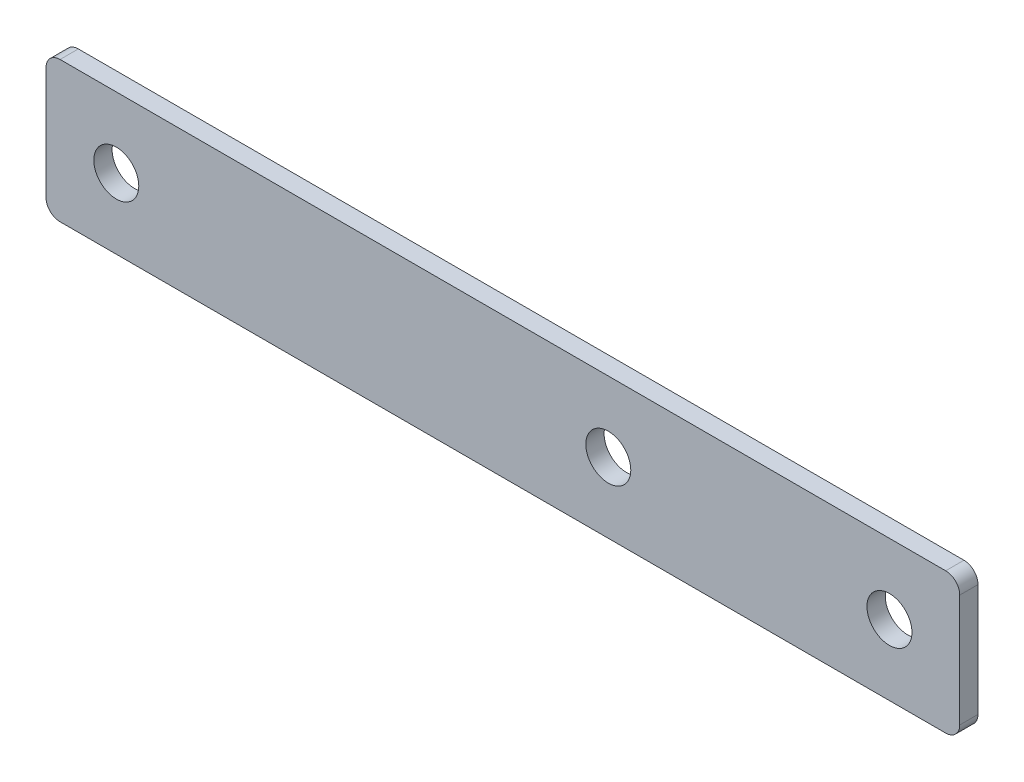
ISO-10303-21;
HEADER;
FILE_DESCRIPTION(('STEP AP214'),'2;1');
FILE_NAME('part.step','',(''),(''),'','','');
FILE_SCHEMA(('AUTOMOTIVE_DESIGN { 1 0 10303 214 1 1 1 1 }'));
ENDSEC;
DATA;
#1=APPLICATION_CONTEXT('core data for automotive mechanical design processes');
#2=APPLICATION_PROTOCOL_DEFINITION('international standard','automotive_design',2000,#1);
#3=PRODUCT_CONTEXT('',#1,'mechanical');
#4=PRODUCT('Part','Part','',(#3));
#5=PRODUCT_RELATED_PRODUCT_CATEGORY('part','',(#4));
#6=PRODUCT_DEFINITION_FORMATION('','',#4);
#7=PRODUCT_DEFINITION_CONTEXT('part definition',#1,'design');
#8=PRODUCT_DEFINITION('design','',#6,#7);
#9=PRODUCT_DEFINITION_SHAPE('','',#8);
#10=(LENGTH_UNIT() NAMED_UNIT(*) SI_UNIT(.MILLI.,.METRE.));
#11=(NAMED_UNIT(*) PLANE_ANGLE_UNIT() SI_UNIT($,.RADIAN.));
#12=(NAMED_UNIT(*) SI_UNIT($,.STERADIAN.) SOLID_ANGLE_UNIT());
#13=UNCERTAINTY_MEASURE_WITH_UNIT(LENGTH_MEASURE(1.E-05),#10,'distance_accuracy_value','');
#14=(GEOMETRIC_REPRESENTATION_CONTEXT(3) GLOBAL_UNCERTAINTY_ASSIGNED_CONTEXT((#13)) GLOBAL_UNIT_ASSIGNED_CONTEXT((#10,
#11,#12)) REPRESENTATION_CONTEXT('',''));
#15=CARTESIAN_POINT('',(0.,0.,0.));
#16=DIRECTION('',(0.,0.,1.));
#17=DIRECTION('',(1.,0.,0.));
#18=AXIS2_PLACEMENT_3D('',#15,#16,#17);
#19=CARTESIAN_POINT('',(0.,0.,1.3));
#20=DIRECTION('',(0.,0.,1.));
#21=DIRECTION('',(1.,0.,0.));
#22=AXIS2_PLACEMENT_3D('',#19,#20,#21);
#23=PLANE('',#22);
#24=CARTESIAN_POINT('',(40.,5.,1.3));
#25=DIRECTION('',(0.,0.,1.));
#26=DIRECTION('',(1.,0.,0.));
#27=AXIS2_PLACEMENT_3D('',#24,#25,#26);
#28=CIRCLE('',#27,1.6);
#29=CARTESIAN_POINT('',(41.6,5.,1.3));
#30=VERTEX_POINT('',#29);
#31=EDGE_CURVE('E181',#30,#30,#28,.T.);
#32=ORIENTED_EDGE('',*,*,#31,.F.);
#33=EDGE_LOOP('',(#32));
#34=FACE_BOUND('',#33,.T.);
#35=DIRECTION('',(1.,0.,0.));
#36=VECTOR('',#35,1.);
#37=CARTESIAN_POINT('',(0.,0.,1.3));
#38=LINE('',#37,#36);
#39=CARTESIAN_POINT('',(1.,0.,1.3));
#40=VERTEX_POINT('',#39);
#41=CARTESIAN_POINT('',(64.,0.,1.3));
#42=VERTEX_POINT('',#41);
#43=EDGE_CURVE('E176',#40,#42,#38,.T.);
#44=ORIENTED_EDGE('',*,*,#43,.T.);
#45=CARTESIAN_POINT('',(64.,0.999999999999999,1.3));
#46=DIRECTION('',(0.,0.,1.));
#47=DIRECTION('',(1.,0.,0.));
#48=AXIS2_PLACEMENT_3D('',#45,#46,#47);
#49=CIRCLE('',#48,1.);
#50=CARTESIAN_POINT('',(65.,0.999999999999999,1.3));
#51=VERTEX_POINT('',#50);
#52=EDGE_CURVE('E153',#42,#51,#49,.T.);
#53=ORIENTED_EDGE('',*,*,#52,.T.);
#54=DIRECTION('',(0.,1.,0.));
#55=VECTOR('',#54,1.);
#56=CARTESIAN_POINT('',(65.,10.,1.3));
#57=LINE('',#56,#55);
#58=CARTESIAN_POINT('',(65.,9.,1.3));
#59=VERTEX_POINT('',#58);
#60=EDGE_CURVE('E123',#51,#59,#57,.T.);
#61=ORIENTED_EDGE('',*,*,#60,.T.);
#62=CARTESIAN_POINT('',(64.,9.,1.3));
#63=DIRECTION('',(0.,0.,1.));
#64=DIRECTION('',(1.,0.,0.));
#65=AXIS2_PLACEMENT_3D('',#62,#63,#64);
#66=CIRCLE('',#65,1.);
#67=CARTESIAN_POINT('',(64.,10.,1.3));
#68=VERTEX_POINT('',#67);
#69=EDGE_CURVE('E60',#59,#68,#66,.T.);
#70=ORIENTED_EDGE('',*,*,#69,.T.);
#71=DIRECTION('',(-1.,0.,0.));
#72=VECTOR('',#71,1.);
#73=CARTESIAN_POINT('',(0.,10.,1.3));
#74=LINE('',#73,#72);
#75=CARTESIAN_POINT('',(1.,10.,1.3));
#76=VERTEX_POINT('',#75);
#77=EDGE_CURVE('E139',#68,#76,#74,.T.);
#78=ORIENTED_EDGE('',*,*,#77,.T.);
#79=CARTESIAN_POINT('',(1.,9.,1.3));
#80=DIRECTION('',(0.,0.,1.));
#81=DIRECTION('',(1.,0.,0.));
#82=AXIS2_PLACEMENT_3D('',#79,#80,#81);
#83=CIRCLE('',#82,1.);
#84=CARTESIAN_POINT('',(0.,9.,1.3));
#85=VERTEX_POINT('',#84);
#86=EDGE_CURVE('E148',#76,#85,#83,.T.);
#87=ORIENTED_EDGE('',*,*,#86,.T.);
#88=DIRECTION('',(0.,-1.,0.));
#89=VECTOR('',#88,1.);
#90=CARTESIAN_POINT('',(0.,10.,1.3));
#91=LINE('',#90,#89);
#92=CARTESIAN_POINT('',(0.,0.999999999999999,1.3));
#93=VERTEX_POINT('',#92);
#94=EDGE_CURVE('E133',#85,#93,#91,.T.);
#95=ORIENTED_EDGE('',*,*,#94,.T.);
#96=CARTESIAN_POINT('',(1.,1.,1.3));
#97=DIRECTION('',(0.,0.,1.));
#98=DIRECTION('',(1.,0.,0.));
#99=AXIS2_PLACEMENT_3D('',#96,#97,#98);
#100=CIRCLE('',#99,1.);
#101=EDGE_CURVE('E150',#93,#40,#100,.T.);
#102=ORIENTED_EDGE('',*,*,#101,.T.);
#103=EDGE_LOOP('',(#44,#53,#61,#70,#78,#87,#95,#102));
#104=FACE_BOUND('',#103,.T.);
#105=CARTESIAN_POINT('',(60.,5.,1.3));
#106=DIRECTION('',(0.,0.,1.));
#107=DIRECTION('',(1.,0.,0.));
#108=AXIS2_PLACEMENT_3D('',#105,#106,#107);
#109=CIRCLE('',#108,1.6);
#110=CARTESIAN_POINT('',(61.6,5.,1.3));
#111=VERTEX_POINT('',#110);
#112=EDGE_CURVE('E169',#111,#111,#109,.T.);
#113=ORIENTED_EDGE('',*,*,#112,.F.);
#114=EDGE_LOOP('',(#113));
#115=FACE_BOUND('',#114,.T.);
#116=CARTESIAN_POINT('',(5.,5.,1.3));
#117=DIRECTION('',(0.,0.,1.));
#118=DIRECTION('',(1.,0.,0.));
#119=AXIS2_PLACEMENT_3D('',#116,#117,#118);
#120=CIRCLE('',#119,1.6);
#121=CARTESIAN_POINT('',(6.6,5.,1.3));
#122=VERTEX_POINT('',#121);
#123=EDGE_CURVE('E186',#122,#122,#120,.T.);
#124=ORIENTED_EDGE('',*,*,#123,.F.);
#125=EDGE_LOOP('',(#124));
#126=FACE_BOUND('',#125,.T.);
#127=ADVANCED_FACE('F38',(#34,#104,#115,#126),#23,.T.);
#128=CARTESIAN_POINT('',(0.,0.,0.));
#129=DIRECTION('',(0.,0.,1.));
#130=DIRECTION('',(1.,0.,0.));
#131=AXIS2_PLACEMENT_3D('',#128,#129,#130);
#132=PLANE('',#131);
#133=DIRECTION('',(0.,1.,0.));
#134=VECTOR('',#133,1.);
#135=CARTESIAN_POINT('',(65.,10.,0.));
#136=LINE('',#135,#134);
#137=CARTESIAN_POINT('',(65.,0.999999999999999,0.));
#138=VERTEX_POINT('',#137);
#139=CARTESIAN_POINT('',(65.,9.,0.));
#140=VERTEX_POINT('',#139);
#141=EDGE_CURVE('E121',#138,#140,#136,.T.);
#142=ORIENTED_EDGE('',*,*,#141,.F.);
#143=CARTESIAN_POINT('',(64.,0.999999999999999,0.));
#144=DIRECTION('',(0.,0.,1.));
#145=DIRECTION('',(1.,0.,0.));
#146=AXIS2_PLACEMENT_3D('',#143,#144,#145);
#147=CIRCLE('',#146,1.);
#148=CARTESIAN_POINT('',(64.,0.,0.));
#149=VERTEX_POINT('',#148);
#150=EDGE_CURVE('E104',#138,#149,#147,.F.);
#151=ORIENTED_EDGE('',*,*,#150,.T.);
#152=DIRECTION('',(1.,0.,0.));
#153=VECTOR('',#152,1.);
#154=CARTESIAN_POINT('',(0.,0.,0.));
#155=LINE('',#154,#153);
#156=CARTESIAN_POINT('',(1.,0.,0.));
#157=VERTEX_POINT('',#156);
#158=EDGE_CURVE('E131',#157,#149,#155,.T.);
#159=ORIENTED_EDGE('',*,*,#158,.F.);
#160=CARTESIAN_POINT('',(1.,1.,0.));
#161=DIRECTION('',(0.,0.,1.));
#162=DIRECTION('',(1.,0.,0.));
#163=AXIS2_PLACEMENT_3D('',#160,#161,#162);
#164=CIRCLE('',#163,1.);
#165=CARTESIAN_POINT('',(0.,0.999999999999999,0.));
#166=VERTEX_POINT('',#165);
#167=EDGE_CURVE('E142',#157,#166,#164,.F.);
#168=ORIENTED_EDGE('',*,*,#167,.T.);
#169=DIRECTION('',(0.,-1.,0.));
#170=VECTOR('',#169,1.);
#171=CARTESIAN_POINT('',(0.,10.,0.));
#172=LINE('',#171,#170);
#173=CARTESIAN_POINT('',(0.,9.,0.));
#174=VERTEX_POINT('',#173);
#175=EDGE_CURVE('E135',#174,#166,#172,.T.);
#176=ORIENTED_EDGE('',*,*,#175,.F.);
#177=CARTESIAN_POINT('',(1.,9.,0.));
#178=DIRECTION('',(0.,0.,1.));
#179=DIRECTION('',(1.,0.,0.));
#180=AXIS2_PLACEMENT_3D('',#177,#178,#179);
#181=CIRCLE('',#180,1.);
#182=CARTESIAN_POINT('',(1.,10.,0.));
#183=VERTEX_POINT('',#182);
#184=EDGE_CURVE('E124',#174,#183,#181,.F.);
#185=ORIENTED_EDGE('',*,*,#184,.T.);
#186=DIRECTION('',(-1.,0.,0.));
#187=VECTOR('',#186,1.);
#188=CARTESIAN_POINT('',(0.,10.,0.));
#189=LINE('',#188,#187);
#190=CARTESIAN_POINT('',(64.,10.,0.));
#191=VERTEX_POINT('',#190);
#192=EDGE_CURVE('E130',#191,#183,#189,.T.);
#193=ORIENTED_EDGE('',*,*,#192,.F.);
#194=CARTESIAN_POINT('',(64.,9.,0.));
#195=DIRECTION('',(0.,0.,1.));
#196=DIRECTION('',(1.,0.,0.));
#197=AXIS2_PLACEMENT_3D('',#194,#195,#196);
#198=CIRCLE('',#197,1.);
#199=EDGE_CURVE('E115',#191,#140,#198,.F.);
#200=ORIENTED_EDGE('',*,*,#199,.T.);
#201=EDGE_LOOP('',(#142,#151,#159,#168,#176,#185,#193,#200));
#202=FACE_BOUND('',#201,.T.);
#203=CARTESIAN_POINT('',(60.,5.,0.));
#204=DIRECTION('',(0.,0.,1.));
#205=DIRECTION('',(1.,0.,0.));
#206=AXIS2_PLACEMENT_3D('',#203,#204,#205);
#207=CIRCLE('',#206,1.6);
#208=CARTESIAN_POINT('',(61.6,5.,0.));
#209=VERTEX_POINT('',#208);
#210=EDGE_CURVE('E171',#209,#209,#207,.T.);
#211=ORIENTED_EDGE('',*,*,#210,.T.);
#212=EDGE_LOOP('',(#211));
#213=FACE_BOUND('',#212,.T.);
#214=CARTESIAN_POINT('',(40.,5.,0.));
#215=DIRECTION('',(0.,0.,1.));
#216=DIRECTION('',(1.,0.,0.));
#217=AXIS2_PLACEMENT_3D('',#214,#215,#216);
#218=CIRCLE('',#217,1.6);
#219=CARTESIAN_POINT('',(41.6,5.,0.));
#220=VERTEX_POINT('',#219);
#221=EDGE_CURVE('E183',#220,#220,#218,.T.);
#222=ORIENTED_EDGE('',*,*,#221,.T.);
#223=EDGE_LOOP('',(#222));
#224=FACE_BOUND('',#223,.T.);
#225=CARTESIAN_POINT('',(5.,5.,0.));
#226=DIRECTION('',(0.,0.,1.));
#227=DIRECTION('',(1.,0.,0.));
#228=AXIS2_PLACEMENT_3D('',#225,#226,#227);
#229=CIRCLE('',#228,1.6);
#230=CARTESIAN_POINT('',(6.6,5.,0.));
#231=VERTEX_POINT('',#230);
#232=EDGE_CURVE('E189',#231,#231,#229,.T.);
#233=ORIENTED_EDGE('',*,*,#232,.T.);
#234=EDGE_LOOP('',(#233));
#235=FACE_BOUND('',#234,.T.);
#236=ADVANCED_FACE('F127',(#202,#213,#224,#235),#132,.F.);
#237=CARTESIAN_POINT('',(0.,10.,1.3));
#238=DIRECTION('',(1.,0.,0.));
#239=DIRECTION('',(0.,0.,-1.));
#240=AXIS2_PLACEMENT_3D('',#237,#238,#239);
#241=PLANE('',#240);
#242=ORIENTED_EDGE('',*,*,#175,.T.);
#243=DIRECTION('',(0.,0.,-1.));
#244=VECTOR('',#243,1.);
#245=CARTESIAN_POINT('',(0.,0.999999999999999,1.3));
#246=LINE('',#245,#244);
#247=EDGE_CURVE('E11',#166,#93,#246,.F.);
#248=ORIENTED_EDGE('',*,*,#247,.T.);
#249=ORIENTED_EDGE('',*,*,#94,.F.);
#250=DIRECTION('',(0.,0.,-1.));
#251=VECTOR('',#250,1.);
#252=CARTESIAN_POINT('',(0.,9.,1.3));
#253=LINE('',#252,#251);
#254=EDGE_CURVE('E46',#85,#174,#253,.T.);
#255=ORIENTED_EDGE('',*,*,#254,.T.);
#256=EDGE_LOOP('',(#242,#248,#249,#255));
#257=FACE_BOUND('',#256,.T.);
#258=ADVANCED_FACE('F164',(#257),#241,.F.);
#259=CARTESIAN_POINT('',(0.,0.,1.3));
#260=DIRECTION('',(0.,1.,0.));
#261=DIRECTION('',(0.,0.,1.));
#262=AXIS2_PLACEMENT_3D('',#259,#260,#261);
#263=PLANE('',#262);
#264=ORIENTED_EDGE('',*,*,#158,.T.);
#265=DIRECTION('',(0.,0.,-1.));
#266=VECTOR('',#265,1.);
#267=CARTESIAN_POINT('',(64.,0.,1.3));
#268=LINE('',#267,#266);
#269=EDGE_CURVE('E109',#149,#42,#268,.F.);
#270=ORIENTED_EDGE('',*,*,#269,.T.);
#271=ORIENTED_EDGE('',*,*,#43,.F.);
#272=DIRECTION('',(0.,0.,-1.));
#273=VECTOR('',#272,1.);
#274=CARTESIAN_POINT('',(1.,0.,1.3));
#275=LINE('',#274,#273);
#276=EDGE_CURVE('E114',#40,#157,#275,.T.);
#277=ORIENTED_EDGE('',*,*,#276,.T.);
#278=EDGE_LOOP('',(#264,#270,#271,#277));
#279=FACE_BOUND('',#278,.T.);
#280=ADVANCED_FACE('F215',(#279),#263,.F.);
#281=CARTESIAN_POINT('',(65.,10.,1.3));
#282=DIRECTION('',(-1.,0.,0.));
#283=DIRECTION('',(0.,0.,1.));
#284=AXIS2_PLACEMENT_3D('',#281,#282,#283);
#285=PLANE('',#284);
#286=ORIENTED_EDGE('',*,*,#60,.F.);
#287=DIRECTION('',(0.,0.,-1.));
#288=VECTOR('',#287,1.);
#289=CARTESIAN_POINT('',(65.,0.999999999999999,1.3));
#290=LINE('',#289,#288);
#291=EDGE_CURVE('E108',#51,#138,#290,.T.);
#292=ORIENTED_EDGE('',*,*,#291,.T.);
#293=ORIENTED_EDGE('',*,*,#141,.T.);
#294=DIRECTION('',(0.,0.,-1.));
#295=VECTOR('',#294,1.);
#296=CARTESIAN_POINT('',(65.,9.,1.3));
#297=LINE('',#296,#295);
#298=EDGE_CURVE('E125',#140,#59,#297,.F.);
#299=ORIENTED_EDGE('',*,*,#298,.T.);
#300=EDGE_LOOP('',(#286,#292,#293,#299));
#301=FACE_BOUND('',#300,.T.);
#302=ADVANCED_FACE('F120',(#301),#285,.F.);
#303=CARTESIAN_POINT('',(0.,10.,1.3));
#304=DIRECTION('',(0.,-1.,0.));
#305=DIRECTION('',(0.,0.,-1.));
#306=AXIS2_PLACEMENT_3D('',#303,#304,#305);
#307=PLANE('',#306);
#308=ORIENTED_EDGE('',*,*,#77,.F.);
#309=DIRECTION('',(0.,0.,-1.));
#310=VECTOR('',#309,1.);
#311=CARTESIAN_POINT('',(64.,10.,1.3));
#312=LINE('',#311,#310);
#313=EDGE_CURVE('E156',#68,#191,#312,.T.);
#314=ORIENTED_EDGE('',*,*,#313,.T.);
#315=ORIENTED_EDGE('',*,*,#192,.T.);
#316=DIRECTION('',(0.,0.,-1.));
#317=VECTOR('',#316,1.);
#318=CARTESIAN_POINT('',(1.,10.,1.3));
#319=LINE('',#318,#317);
#320=EDGE_CURVE('E53',#183,#76,#319,.F.);
#321=ORIENTED_EDGE('',*,*,#320,.T.);
#322=EDGE_LOOP('',(#308,#314,#315,#321));
#323=FACE_BOUND('',#322,.T.);
#324=ADVANCED_FACE('F210',(#323),#307,.F.);
#325=CARTESIAN_POINT('',(60.,5.,1.3));
#326=DIRECTION('',(0.,0.,-1.));
#327=DIRECTION('',(-1.,0.,0.));
#328=AXIS2_PLACEMENT_3D('',#325,#326,#327);
#329=CYLINDRICAL_SURFACE('',#328,1.6);
#330=ORIENTED_EDGE('',*,*,#112,.T.);
#331=EDGE_LOOP('',(#330));
#332=FACE_BOUND('',#331,.T.);
#333=ORIENTED_EDGE('',*,*,#210,.F.);
#334=EDGE_LOOP('',(#333));
#335=FACE_BOUND('',#334,.T.);
#336=ADVANCED_FACE('F207',(#332,#335),#329,.F.);
#337=CARTESIAN_POINT('',(40.,5.,1.3));
#338=DIRECTION('',(0.,0.,-1.));
#339=DIRECTION('',(-1.,0.,0.));
#340=AXIS2_PLACEMENT_3D('',#337,#338,#339);
#341=CYLINDRICAL_SURFACE('',#340,1.6);
#342=ORIENTED_EDGE('',*,*,#31,.T.);
#343=EDGE_LOOP('',(#342));
#344=FACE_BOUND('',#343,.T.);
#345=ORIENTED_EDGE('',*,*,#221,.F.);
#346=EDGE_LOOP('',(#345));
#347=FACE_BOUND('',#346,.T.);
#348=ADVANCED_FACE('F241',(#344,#347),#341,.F.);
#349=CARTESIAN_POINT('',(5.,5.,1.3));
#350=DIRECTION('',(0.,0.,-1.));
#351=DIRECTION('',(-1.,0.,0.));
#352=AXIS2_PLACEMENT_3D('',#349,#350,#351);
#353=CYLINDRICAL_SURFACE('',#352,1.6);
#354=ORIENTED_EDGE('',*,*,#123,.T.);
#355=EDGE_LOOP('',(#354));
#356=FACE_BOUND('',#355,.T.);
#357=ORIENTED_EDGE('',*,*,#232,.F.);
#358=EDGE_LOOP('',(#357));
#359=FACE_BOUND('',#358,.T.);
#360=ADVANCED_FACE('F195',(#356,#359),#353,.F.);
#361=CARTESIAN_POINT('',(64.,0.999999999999999,1.3));
#362=DIRECTION('',(0.,0.,-1.));
#363=DIRECTION('',(-1.,0.,0.));
#364=AXIS2_PLACEMENT_3D('',#361,#362,#363);
#365=CYLINDRICAL_SURFACE('',#364,1.);
#366=ORIENTED_EDGE('',*,*,#52,.F.);
#367=ORIENTED_EDGE('',*,*,#269,.F.);
#368=ORIENTED_EDGE('',*,*,#150,.F.);
#369=ORIENTED_EDGE('',*,*,#291,.F.);
#370=EDGE_LOOP('',(#366,#367,#368,#369));
#371=FACE_BOUND('',#370,.T.);
#372=ADVANCED_FACE('F107',(#371),#365,.T.);
#373=CARTESIAN_POINT('',(64.,9.,1.3));
#374=DIRECTION('',(0.,0.,-1.));
#375=DIRECTION('',(-1.,0.,0.));
#376=AXIS2_PLACEMENT_3D('',#373,#374,#375);
#377=CYLINDRICAL_SURFACE('',#376,1.);
#378=ORIENTED_EDGE('',*,*,#69,.F.);
#379=ORIENTED_EDGE('',*,*,#298,.F.);
#380=ORIENTED_EDGE('',*,*,#199,.F.);
#381=ORIENTED_EDGE('',*,*,#313,.F.);
#382=EDGE_LOOP('',(#378,#379,#380,#381));
#383=FACE_BOUND('',#382,.T.);
#384=ADVANCED_FACE('F223',(#383),#377,.T.);
#385=CARTESIAN_POINT('',(1.,1.,1.3));
#386=DIRECTION('',(0.,0.,-1.));
#387=DIRECTION('',(-1.,0.,0.));
#388=AXIS2_PLACEMENT_3D('',#385,#386,#387);
#389=CYLINDRICAL_SURFACE('',#388,1.);
#390=ORIENTED_EDGE('',*,*,#101,.F.);
#391=ORIENTED_EDGE('',*,*,#247,.F.);
#392=ORIENTED_EDGE('',*,*,#167,.F.);
#393=ORIENTED_EDGE('',*,*,#276,.F.);
#394=EDGE_LOOP('',(#390,#391,#392,#393));
#395=FACE_BOUND('',#394,.T.);
#396=ADVANCED_FACE('F225',(#395),#389,.T.);
#397=CARTESIAN_POINT('',(1.,9.,1.3));
#398=DIRECTION('',(0.,0.,-1.));
#399=DIRECTION('',(-1.,0.,0.));
#400=AXIS2_PLACEMENT_3D('',#397,#398,#399);
#401=CYLINDRICAL_SURFACE('',#400,1.);
#402=ORIENTED_EDGE('',*,*,#86,.F.);
#403=ORIENTED_EDGE('',*,*,#320,.F.);
#404=ORIENTED_EDGE('',*,*,#184,.F.);
#405=ORIENTED_EDGE('',*,*,#254,.F.);
#406=EDGE_LOOP('',(#402,#403,#404,#405));
#407=FACE_BOUND('',#406,.T.);
#408=ADVANCED_FACE('F40',(#407),#401,.T.);
#409=CLOSED_SHELL('',(#127,#236,#258,#280,#302,#324,#336,#348,#360,#372,#384,#396,#408));
#410=MANIFOLD_SOLID_BREP('B2',#409);
#411=ADVANCED_BREP_SHAPE_REPRESENTATION('',(#18,#410),#14);
#412=SHAPE_DEFINITION_REPRESENTATION(#9,#411);
ENDSEC;
END-ISO-10303-21;
